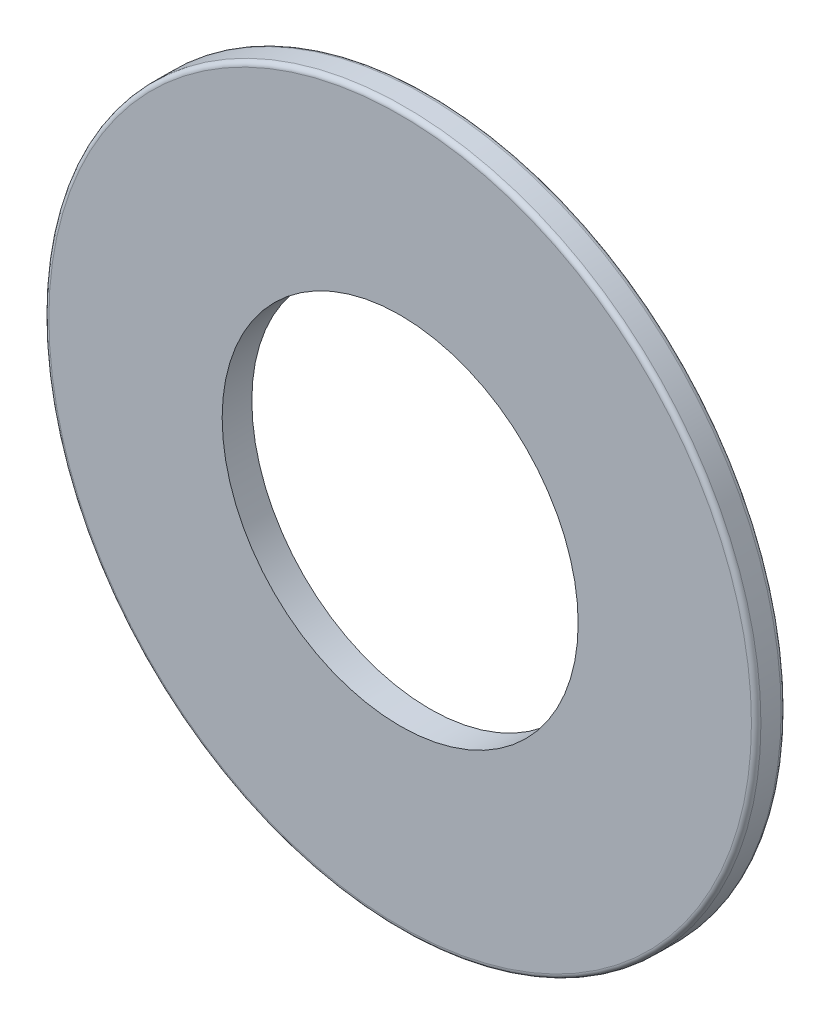
ISO-10303-21;
HEADER;
FILE_DESCRIPTION(('STEP AP214'),'2;1');
FILE_NAME('part.step','',(''),(''),'','','');
FILE_SCHEMA(('AUTOMOTIVE_DESIGN { 1 0 10303 214 1 1 1 1 }'));
ENDSEC;
DATA;
#1=APPLICATION_CONTEXT('core data for automotive mechanical design processes');
#2=APPLICATION_PROTOCOL_DEFINITION('international standard','automotive_design',2000,#1);
#3=PRODUCT_CONTEXT('',#1,'mechanical');
#4=PRODUCT('Part','Part','',(#3));
#5=PRODUCT_RELATED_PRODUCT_CATEGORY('part','',(#4));
#6=PRODUCT_DEFINITION_FORMATION('','',#4);
#7=PRODUCT_DEFINITION_CONTEXT('part definition',#1,'design');
#8=PRODUCT_DEFINITION('design','',#6,#7);
#9=PRODUCT_DEFINITION_SHAPE('','',#8);
#10=(LENGTH_UNIT() NAMED_UNIT(*) SI_UNIT(.MILLI.,.METRE.));
#11=(NAMED_UNIT(*) PLANE_ANGLE_UNIT() SI_UNIT($,.RADIAN.));
#12=(NAMED_UNIT(*) SI_UNIT($,.STERADIAN.) SOLID_ANGLE_UNIT());
#13=UNCERTAINTY_MEASURE_WITH_UNIT(LENGTH_MEASURE(1.E-05),#10,'distance_accuracy_value','');
#14=(GEOMETRIC_REPRESENTATION_CONTEXT(3) GLOBAL_UNCERTAINTY_ASSIGNED_CONTEXT((#13)) GLOBAL_UNIT_ASSIGNED_CONTEXT((#10,
#11,#12)) REPRESENTATION_CONTEXT('',''));
#15=CARTESIAN_POINT('',(0.,0.,0.));
#16=DIRECTION('',(0.,0.,1.));
#17=DIRECTION('',(1.,0.,0.));
#18=AXIS2_PLACEMENT_3D('',#15,#16,#17);
#19=CARTESIAN_POINT('',(0.,0.,0.79375));
#20=DIRECTION('',(0.,0.,1.));
#21=DIRECTION('',(1.,0.,0.));
#22=AXIS2_PLACEMENT_3D('',#19,#20,#21);
#23=PLANE('',#22);
#24=CARTESIAN_POINT('',(0.,0.,0.79375));
#25=DIRECTION('',(0.,0.,1.));
#26=DIRECTION('',(1.,0.,0.));
#27=AXIS2_PLACEMENT_3D('',#24,#25,#26);
#28=CIRCLE('',#27,9.398);
#29=CARTESIAN_POINT('',(9.398,0.,0.79375));
#30=VERTEX_POINT('',#29);
#31=EDGE_CURVE('E10',#30,#30,#28,.T.);
#32=ORIENTED_EDGE('',*,*,#31,.T.);
#33=EDGE_LOOP('',(#32));
#34=FACE_BOUND('',#33,.T.);
#35=CARTESIAN_POINT('',(0.,0.,0.79375));
#36=DIRECTION('',(0.,0.,1.));
#37=DIRECTION('',(1.,0.,0.));
#38=AXIS2_PLACEMENT_3D('',#35,#36,#37);
#39=CIRCLE('',#38,4.7625);
#40=CARTESIAN_POINT('',(4.7625,0.,0.79375));
#41=VERTEX_POINT('',#40);
#42=EDGE_CURVE('E53',#41,#41,#39,.T.);
#43=ORIENTED_EDGE('',*,*,#42,.F.);
#44=EDGE_LOOP('',(#43));
#45=FACE_BOUND('',#44,.T.);
#46=ADVANCED_FACE('F33',(#34,#45),#23,.T.);
#47=CARTESIAN_POINT('',(0.,0.,0.));
#48=DIRECTION('',(0.,0.,1.));
#49=DIRECTION('',(1.,0.,0.));
#50=AXIS2_PLACEMENT_3D('',#47,#48,#49);
#51=PLANE('',#50);
#52=CARTESIAN_POINT('',(0.,0.,0.));
#53=DIRECTION('',(0.,0.,1.));
#54=DIRECTION('',(1.,0.,0.));
#55=AXIS2_PLACEMENT_3D('',#52,#53,#54);
#56=CIRCLE('',#55,9.398);
#57=CARTESIAN_POINT('',(9.398,0.,0.));
#58=VERTEX_POINT('',#57);
#59=EDGE_CURVE('E40',#58,#58,#56,.F.);
#60=ORIENTED_EDGE('',*,*,#59,.T.);
#61=EDGE_LOOP('',(#60));
#62=FACE_BOUND('',#61,.T.);
#63=CARTESIAN_POINT('',(0.,0.,0.));
#64=DIRECTION('',(0.,0.,1.));
#65=DIRECTION('',(1.,0.,0.));
#66=AXIS2_PLACEMENT_3D('',#63,#64,#65);
#67=CIRCLE('',#66,4.7625);
#68=CARTESIAN_POINT('',(4.7625,0.,0.));
#69=VERTEX_POINT('',#68);
#70=EDGE_CURVE('E54',#69,#69,#67,.T.);
#71=ORIENTED_EDGE('',*,*,#70,.T.);
#72=EDGE_LOOP('',(#71));
#73=FACE_BOUND('',#72,.T.);
#74=ADVANCED_FACE('F64',(#62,#73),#51,.F.);
#75=CARTESIAN_POINT('',(0.,0.,0.79375));
#76=DIRECTION('',(0.,0.,-1.));
#77=DIRECTION('',(-1.,0.,0.));
#78=AXIS2_PLACEMENT_3D('',#75,#76,#77);
#79=CYLINDRICAL_SURFACE('',#78,9.525);
#80=CARTESIAN_POINT('',(0.,0.,0.127));
#81=DIRECTION('',(0.,0.,1.));
#82=DIRECTION('',(1.,0.,0.));
#83=AXIS2_PLACEMENT_3D('',#80,#81,#82);
#84=CIRCLE('',#83,9.525);
#85=CARTESIAN_POINT('',(9.525,0.,0.127));
#86=VERTEX_POINT('',#85);
#87=EDGE_CURVE('E44',#86,#86,#84,.T.);
#88=ORIENTED_EDGE('',*,*,#87,.T.);
#89=EDGE_LOOP('',(#88));
#90=FACE_BOUND('',#89,.T.);
#91=CARTESIAN_POINT('',(0.,0.,0.66675));
#92=DIRECTION('',(0.,0.,1.));
#93=DIRECTION('',(1.,0.,0.));
#94=AXIS2_PLACEMENT_3D('',#91,#92,#93);
#95=CIRCLE('',#94,9.525);
#96=CARTESIAN_POINT('',(9.525,0.,0.66675));
#97=VERTEX_POINT('',#96);
#98=EDGE_CURVE('E48',#97,#97,#95,.F.);
#99=ORIENTED_EDGE('',*,*,#98,.T.);
#100=EDGE_LOOP('',(#99));
#101=FACE_BOUND('',#100,.T.);
#102=ADVANCED_FACE('F69',(#90,#101),#79,.T.);
#103=CARTESIAN_POINT('',(0.,0.,0.79375));
#104=DIRECTION('',(0.,0.,-1.));
#105=DIRECTION('',(-1.,0.,0.));
#106=AXIS2_PLACEMENT_3D('',#103,#104,#105);
#107=CYLINDRICAL_SURFACE('',#106,4.7625);
#108=ORIENTED_EDGE('',*,*,#42,.T.);
#109=EDGE_LOOP('',(#108));
#110=FACE_BOUND('',#109,.T.);
#111=ORIENTED_EDGE('',*,*,#70,.F.);
#112=EDGE_LOOP('',(#111));
#113=FACE_BOUND('',#112,.T.);
#114=ADVANCED_FACE('F60',(#110,#113),#107,.F.);
#115=CARTESIAN_POINT('',(0.,0.,0.127));
#116=DIRECTION('',(0.,0.,1.));
#117=DIRECTION('',(1.,0.,0.));
#118=AXIS2_PLACEMENT_3D('',#115,#116,#117);
#119=TOROIDAL_SURFACE('',#118,9.398,0.127);
#120=ORIENTED_EDGE('',*,*,#59,.F.);
#121=EDGE_LOOP('',(#120));
#122=FACE_BOUND('',#121,.T.);
#123=ORIENTED_EDGE('',*,*,#87,.F.);
#124=EDGE_LOOP('',(#123));
#125=FACE_BOUND('',#124,.T.);
#126=ADVANCED_FACE('F75',(#122,#125),#119,.T.);
#127=CARTESIAN_POINT('',(0.,0.,0.66675));
#128=DIRECTION('',(0.,0.,1.));
#129=DIRECTION('',(1.,0.,0.));
#130=AXIS2_PLACEMENT_3D('',#127,#128,#129);
#131=TOROIDAL_SURFACE('',#130,9.398,0.127);
#132=ORIENTED_EDGE('',*,*,#98,.F.);
#133=EDGE_LOOP('',(#132));
#134=FACE_BOUND('',#133,.T.);
#135=ORIENTED_EDGE('',*,*,#31,.F.);
#136=EDGE_LOOP('',(#135));
#137=FACE_BOUND('',#136,.T.);
#138=ADVANCED_FACE('F35',(#134,#137),#131,.T.);
#139=CLOSED_SHELL('',(#46,#74,#102,#114,#126,#138));
#140=MANIFOLD_SOLID_BREP('B2',#139);
#141=ADVANCED_BREP_SHAPE_REPRESENTATION('',(#18,#140),#14);
#142=SHAPE_DEFINITION_REPRESENTATION(#9,#141);
ENDSEC;
END-ISO-10303-21;
